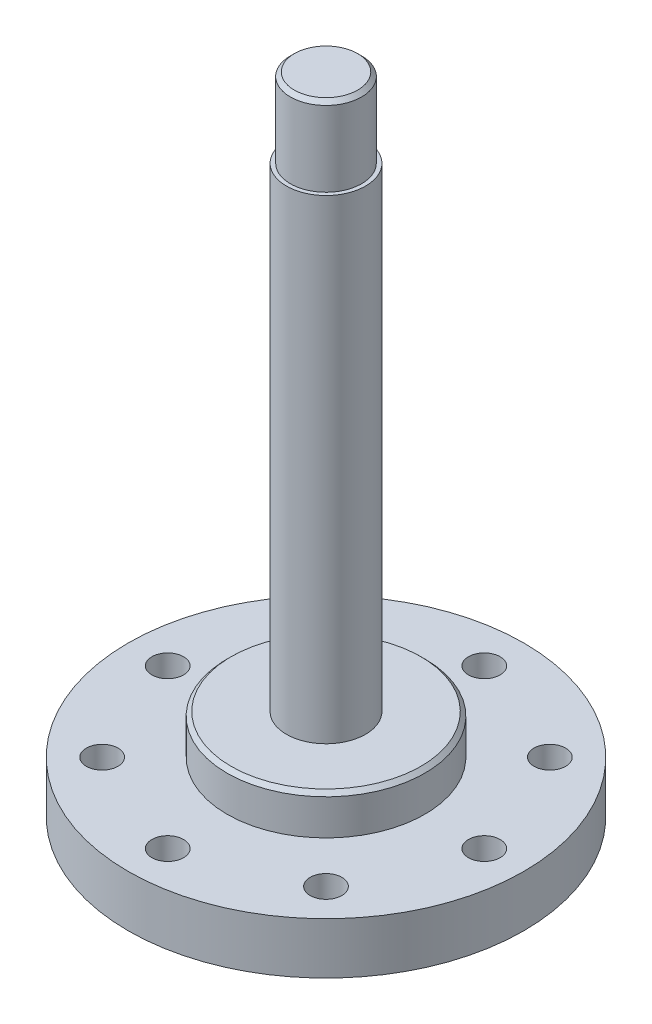
ISO-10303-21;
HEADER;
FILE_DESCRIPTION(('STEP AP214'),'2;1');
FILE_NAME('part.step','',(''),(''),'','','');
FILE_SCHEMA(('AUTOMOTIVE_DESIGN { 1 0 10303 214 1 1 1 1 }'));
ENDSEC;
DATA;
#1=APPLICATION_CONTEXT('core data for automotive mechanical design processes');
#2=APPLICATION_PROTOCOL_DEFINITION('international standard','automotive_design',2000,#1);
#3=PRODUCT_CONTEXT('',#1,'mechanical');
#4=PRODUCT('Part','Part','',(#3));
#5=PRODUCT_RELATED_PRODUCT_CATEGORY('part','',(#4));
#6=PRODUCT_DEFINITION_FORMATION('','',#4);
#7=PRODUCT_DEFINITION_CONTEXT('part definition',#1,'design');
#8=PRODUCT_DEFINITION('design','',#6,#7);
#9=PRODUCT_DEFINITION_SHAPE('','',#8);
#10=(LENGTH_UNIT() NAMED_UNIT(*) SI_UNIT(.MILLI.,.METRE.));
#11=(NAMED_UNIT(*) PLANE_ANGLE_UNIT() SI_UNIT($,.RADIAN.));
#12=(NAMED_UNIT(*) SI_UNIT($,.STERADIAN.) SOLID_ANGLE_UNIT());
#13=UNCERTAINTY_MEASURE_WITH_UNIT(LENGTH_MEASURE(1.E-05),#10,'distance_accuracy_value','');
#14=(GEOMETRIC_REPRESENTATION_CONTEXT(3) GLOBAL_UNCERTAINTY_ASSIGNED_CONTEXT((#13)) GLOBAL_UNIT_ASSIGNED_CONTEXT((#10,
#11,#12)) REPRESENTATION_CONTEXT('',''));
#15=CARTESIAN_POINT('',(0.,0.,0.));
#16=DIRECTION('',(0.,0.,1.));
#17=DIRECTION('',(1.,0.,0.));
#18=AXIS2_PLACEMENT_3D('',#15,#16,#17);
#19=CARTESIAN_POINT('',(0.,0.,0.));
#20=DIRECTION('',(0.,-1.,0.));
#21=DIRECTION('',(0.,0.,-1.));
#22=AXIS2_PLACEMENT_3D('',#19,#20,#21);
#23=CYLINDRICAL_SURFACE('',#22,8.99999999999997);
#24=CARTESIAN_POINT('',(-2.,158.000000000003,-8.77496438739209));
#25=CARTESIAN_POINT('',(-2.00000045322512,158.055525070062,-8.7749611563832));
#26=CARTESIAN_POINT('',(-1.99768625513154,158.111022831997,-8.77549207437707));
#27=CARTESIAN_POINT('',(-1.98845940647227,158.221607238545,-8.7775886458812));
#28=CARTESIAN_POINT('',(-1.98154740935906,158.276693940454,-8.77915415235256));
#29=CARTESIAN_POINT('',(-1.95400769283988,158.440542767895,-8.78534174037962));
#30=CARTESIAN_POINT('',(-1.92657587259378,158.548185220393,-8.79145523457123));
#31=CARTESIAN_POINT('',(-1.85442825068594,158.757191285253,-8.80695400655512));
#32=CARTESIAN_POINT('',(-1.80971170740661,158.858554627988,-8.81633942473073));
#33=CARTESIAN_POINT('',(-1.70430928768159,159.052376151746,-8.83731901887102));
#34=CARTESIAN_POINT('',(-1.64362124795972,159.144833124117,-8.84891349398498));
#35=CARTESIAN_POINT('',(-1.50689095324053,159.319771479346,-8.87322727978757));
#36=CARTESIAN_POINT('',(-1.43062605084004,159.402076754204,-8.88596119650304));
#37=CARTESIAN_POINT('',(-1.26535813485257,159.552863054087,-8.91099554522235));
#38=CARTESIAN_POINT('',(-1.1763505255725,159.621339069978,-8.9232958188283));
#39=CARTESIAN_POINT('',(-0.986915380029121,159.743223646819,-8.946239194565));
#40=CARTESIAN_POINT('',(-0.886370405253414,159.796453627775,-8.95686204964387));
#41=CARTESIAN_POINT('',(-0.677557914875121,159.885139541732,-8.97506836310517));
#42=CARTESIAN_POINT('',(-0.569299770399321,159.920616636733,-8.98265543805999));
#43=CARTESIAN_POINT('',(-0.383738033770627,159.964358638689,-8.9921311167354));
#44=CARTESIAN_POINT('',(-0.307646152012311,159.977702266425,-8.99506700135329));
#45=CARTESIAN_POINT('',(-0.154380127231377,159.995524598139,-8.99900234711577));
#46=CARTESIAN_POINT('',(-0.0772059904160005,160.000003352939,-9.00000181936202));
#47=CARTESIAN_POINT('',(0.110852613716563,159.999995185839,-8.99999738775399));
#48=CARTESIAN_POINT('',(0.221770894619487,159.990750367457,-8.99793058177931));
#49=CARTESIAN_POINT('',(0.440474710707489,159.954047573632,-8.98988281570509));
#50=CARTESIAN_POINT('',(0.548257064254706,159.926571730904,-8.98389801585935));
#51=CARTESIAN_POINT('',(0.757464524262974,159.854313239147,-8.96868093927848));
#52=CARTESIAN_POINT('',(0.858896984777141,159.809551057744,-8.95945250427693));
#53=CARTESIAN_POINT('',(1.05280412699015,159.704050920115,-8.93874290359373));
#54=CARTESIAN_POINT('',(1.14527934033796,159.643313912855,-8.92726187173537));
#55=CARTESIAN_POINT('',(1.32018428707594,159.506526044706,-8.90309121222285));
#56=CARTESIAN_POINT('',(1.40244487062325,159.430261609018,-8.89038619714368));
#57=CARTESIAN_POINT('',(1.55312203235356,159.265035087475,-8.86530653184287));
#58=CARTESIAN_POINT('',(1.62153673721995,159.176071286196,-8.85293192652127));
#59=CARTESIAN_POINT('',(1.74334148086182,158.986703861682,-8.82976004663997));
#60=CARTESIAN_POINT('',(1.79654618585851,158.88617846954,-8.81898294101116));
#61=CARTESIAN_POINT('',(1.88521500543983,158.677354247113,-8.80045616785831));
#62=CARTESIAN_POINT('',(1.92069140804127,158.569060860758,-8.79270440419771));
#63=CARTESIAN_POINT('',(1.96440898267864,158.383471081341,-8.78301933671262));
#64=CARTESIAN_POINT('',(1.97773794761973,158.307390305809,-8.78001690428314));
#65=CARTESIAN_POINT('',(1.99553735430618,158.154219220793,-8.77598160009122));
#66=CARTESIAN_POINT('',(2.00001581907926,158.077129889455,-8.77494694456012));
#67=CARTESIAN_POINT('',(2.,158.,-8.7749643873921));
#68=B_SPLINE_CURVE_WITH_KNOTS('',3,(#24,#25,#26,#27,#28,#29,#30,#31,#32,#33,#34,#35,#36,#37,#38,
#39,#40,#41,#42,#43,#44,#45,#46,#47,#48,#49,#50,#51,#52,#53,#54,#55,#56,#57,#58,#59,#60,#61,#62,
#63,#64,#65,#66,#67),.UNSPECIFIED.,.F.,.F.,(4,2,2,2,2,2,2,2,2,2,2,2,2,2,2,2,2,2,2,2,2,4),(0.,
0.16647063367442,0.33291761311478,0.664948115280802,0.996992865114983,1.32908261226772,
1.66630095736818,2.00364122903178,2.34478479664195,2.68552073582845,2.91694151254844,
3.14836096250377,3.48063376613172,3.81323269508712,4.14543901682384,4.47762560866963,
4.81473430369558,5.15188857833218,5.49299120598956,5.83385707613412,6.06524315893335,
6.2964193925688),.UNSPECIFIED.);
#69=CARTESIAN_POINT('',(-2.,158.000000000003,-8.77496438739209));
#70=VERTEX_POINT('',#69);
#71=CARTESIAN_POINT('',(2.,158.,-8.77496438739209));
#72=VERTEX_POINT('',#71);
#73=EDGE_CURVE('E139',#70,#72,#68,.T.);
#74=ORIENTED_EDGE('',*,*,#73,.F.);
#75=DIRECTION('',(0.,-1.,0.));
#76=VECTOR('',#75,1.);
#77=CARTESIAN_POINT('',(-2.00000000000006,0.,-8.77496438739208));
#78=LINE('',#77,#76);
#79=CARTESIAN_POINT('',(-2.,148.000000000003,-8.77496438739209));
#80=VERTEX_POINT('',#79);
#81=EDGE_CURVE('E134',#80,#70,#78,.F.);
#82=ORIENTED_EDGE('',*,*,#81,.F.);
#83=CARTESIAN_POINT('',(2.,148.,-8.77496438739209));
#84=CARTESIAN_POINT('',(2.00000045322516,147.944474929942,-8.77496115638318));
#85=CARTESIAN_POINT('',(1.9976862551317,147.888977168006,-8.77549207437703));
#86=CARTESIAN_POINT('',(1.98845940647267,147.778392761458,-8.77758864588111));
#87=CARTESIAN_POINT('',(1.98154740935959,147.723306059549,-8.77915415235244));
#88=CARTESIAN_POINT('',(1.95400769284051,147.559457232108,-8.78534174037948));
#89=CARTESIAN_POINT('',(1.92657587259412,147.45181477961,-8.79145523457115));
#90=CARTESIAN_POINT('',(1.85442825068672,147.24280871475,-8.80695400655496));
#91=CARTESIAN_POINT('',(1.80971170740813,147.141445372015,-8.81633942473043));
#92=CARTESIAN_POINT('',(1.7043092876832,146.947623848257,-8.8373190188707));
#93=CARTESIAN_POINT('',(1.64362124796069,146.855166875886,-8.84891349398479));
#94=CARTESIAN_POINT('',(1.50689095324172,146.680228520657,-8.87322727978738));
#95=CARTESIAN_POINT('',(1.43062605084209,146.597923245798,-8.88596119650272));
#96=CARTESIAN_POINT('',(1.26535813485479,146.447136945915,-8.91099554522202));
#97=CARTESIAN_POINT('',(1.17635052557401,146.378660930025,-8.92329581882809));
#98=CARTESIAN_POINT('',(0.986915380030634,146.256776353184,-8.94623919456484));
#99=CARTESIAN_POINT('',(0.886370405255663,146.203546372226,-8.95686204964365));
#100=CARTESIAN_POINT('',(0.677557914877532,146.114860458269,-8.97506836310497));
#101=CARTESIAN_POINT('',(0.569299770401157,146.079383363269,-8.98265543805986));
#102=CARTESIAN_POINT('',(0.38373803377203,146.035641361312,-8.99213111673534));
#103=CARTESIAN_POINT('',(0.30764615201358,146.022297733575,-8.99506700135325));
#104=CARTESIAN_POINT('',(0.154380127232152,146.004475401861,-8.99900234711576));
#105=CARTESIAN_POINT('',(0.0772059904164161,145.999996647061,-9.00000181936202));
#106=CARTESIAN_POINT('',(-0.110852613716602,146.000004814161,-8.99999738775399));
#107=CARTESIAN_POINT('',(-0.221770894619627,146.009249632542,-8.99793058177931));
#108=CARTESIAN_POINT('',(-0.440474710707477,146.045952426368,-8.98988281570509));
#109=CARTESIAN_POINT('',(-0.548257064254439,146.073428269097,-8.98389801585938));
#110=CARTESIAN_POINT('',(-0.757464524263099,146.145686760854,-8.96868093927846));
#111=CARTESIAN_POINT('',(-0.858896984777914,146.190448942256,-8.95945250427684));
#112=CARTESIAN_POINT('',(-1.05280412699083,146.295949079886,-8.93874290359366));
#113=CARTESIAN_POINT('',(-1.1452793403379,146.356686087146,-8.92726187173539));
#114=CARTESIAN_POINT('',(-1.32018428707592,146.493473955296,-8.90309121222284));
#115=CARTESIAN_POINT('',(-1.40244487062404,146.569738390983,-8.89038619714355));
#116=CARTESIAN_POINT('',(-1.55312203235438,146.734964912526,-8.86530653184274));
#117=CARTESIAN_POINT('',(-1.62153673721999,146.823928713805,-8.85293192652127));
#118=CARTESIAN_POINT('',(-1.74334148086173,147.01329613832,-8.82976004663998));
#119=CARTESIAN_POINT('',(-1.79654618585907,147.113821530461,-8.81898294101104));
#120=CARTESIAN_POINT('',(-1.88521500544048,147.322645752889,-8.80045616785818));
#121=CARTESIAN_POINT('',(-1.92069140804134,147.430939139243,-8.79270440419769));
#122=CARTESIAN_POINT('',(-1.96440898267863,147.616528918661,-8.78301933671262));
#123=CARTESIAN_POINT('',(-1.97773794761993,147.692609694193,-8.7800169042831));
#124=CARTESIAN_POINT('',(-1.99553735430657,147.84578077921,-8.77598160009113));
#125=CARTESIAN_POINT('',(-2.00001581907965,147.922870110549,-8.77494694456003));
#126=CARTESIAN_POINT('',(-2.,148.000000000003,-8.7749643873921));
#127=B_SPLINE_CURVE_WITH_KNOTS('',3,(#83,#84,#85,#86,#87,#88,#89,#90,#91,#92,#93,#94,#95,#96,
#97,#98,#99,#100,#101,#102,#103,#104,#105,#106,#107,#108,#109,#110,#111,#112,#113,#114,#115,
#116,#117,#118,#119,#120,#121,#122,#123,#124,#125,#126),.UNSPECIFIED.,.F.,.F.,(4,2,2,2,2,2,2,2,
2,2,2,2,2,2,2,2,2,2,2,2,2,4),(0.,0.166470633674519,0.332917613114842,0.664948115280836,
0.996992865115027,1.32908261226785,1.66630095736847,2.00364122903209,2.3447847966423,
2.68552073582904,2.91694151255013,3.14836096250641,3.48063376613443,3.81323269509017,
4.14543901682713,4.47762560867294,4.81473430369895,5.15188857833571,5.49299120599317,
5.83385707613773,6.06524315893786,6.29641939257422),.UNSPECIFIED.);
#128=CARTESIAN_POINT('',(2.,148.,-8.77496438739211));
#129=VERTEX_POINT('',#128);
#130=EDGE_CURVE('E148',#129,#80,#127,.T.);
#131=ORIENTED_EDGE('',*,*,#130,.F.);
#132=DIRECTION('',(0.,-1.,0.));
#133=VECTOR('',#132,1.);
#134=CARTESIAN_POINT('',(2.,0.,-8.77496438739209));
#135=LINE('',#134,#133);
#136=EDGE_CURVE('E146',#129,#72,#135,.F.);
#137=ORIENTED_EDGE('',*,*,#136,.T.);
#138=EDGE_LOOP('',(#74,#82,#131,#137));
#139=FACE_BOUND('',#138,.T.);
#140=CARTESIAN_POINT('',(0.,162.,0.));
#141=DIRECTION('',(0.,1.,0.));
#142=DIRECTION('',(0.,0.,1.));
#143=AXIS2_PLACEMENT_3D('',#140,#141,#142);
#144=CIRCLE('',#143,8.99999999999997);
#145=CARTESIAN_POINT('',(0.,162.,8.99999999999997));
#146=VERTEX_POINT('',#145);
#147=EDGE_CURVE('E218',#146,#146,#144,.F.);
#148=ORIENTED_EDGE('',*,*,#147,.T.);
#149=EDGE_LOOP('',(#148));
#150=FACE_BOUND('',#149,.T.);
#151=CARTESIAN_POINT('',(0.,143.,0.));
#152=DIRECTION('',(0.,-1.,0.));
#153=DIRECTION('',(0.,0.,-1.));
#154=AXIS2_PLACEMENT_3D('',#151,#152,#153);
#155=CIRCLE('',#154,9.);
#156=CARTESIAN_POINT('',(0.,143.,-9.));
#157=VERTEX_POINT('',#156);
#158=EDGE_CURVE('E253',#157,#157,#155,.T.);
#159=ORIENTED_EDGE('',*,*,#158,.F.);
#160=EDGE_LOOP('',(#159));
#161=FACE_BOUND('',#160,.T.);
#162=ADVANCED_FACE('F74',(#139,#150,#161),#23,.T.);
#163=CARTESIAN_POINT('',(0.,0.,0.));
#164=DIRECTION('',(0.,-1.,0.));
#165=DIRECTION('',(0.,0.,-1.));
#166=AXIS2_PLACEMENT_3D('',#163,#164,#165);
#167=PLANE('',#166);
#168=CARTESIAN_POINT('',(-28.2842712474621,0.,-28.2842712474618));
#169=DIRECTION('',(0.,-1.,0.));
#170=DIRECTION('',(0.,0.,-1.));
#171=AXIS2_PLACEMENT_3D('',#168,#169,#170);
#172=CIRCLE('',#171,4.);
#173=CARTESIAN_POINT('',(-28.2842712474621,0.,-32.2842712474617));
#174=VERTEX_POINT('',#173);
#175=EDGE_CURVE('E283',#174,#174,#172,.T.);
#176=ORIENTED_EDGE('',*,*,#175,.F.);
#177=EDGE_LOOP('',(#176));
#178=FACE_BOUND('',#177,.T.);
#179=CARTESIAN_POINT('',(-1.39659253553725E-13,0.,-40.));
#180=DIRECTION('',(0.,-1.,0.));
#181=DIRECTION('',(0.,0.,-1.));
#182=AXIS2_PLACEMENT_3D('',#179,#180,#181);
#183=CIRCLE('',#182,4.);
#184=CARTESIAN_POINT('',(-1.39659253553725E-13,0.,-44.));
#185=VERTEX_POINT('',#184);
#186=EDGE_CURVE('E291',#185,#185,#183,.T.);
#187=ORIENTED_EDGE('',*,*,#186,.F.);
#188=EDGE_LOOP('',(#187));
#189=FACE_BOUND('',#188,.T.);
#190=CARTESIAN_POINT('',(28.2842712474619,0.,-28.284271247462));
#191=DIRECTION('',(0.,-1.,0.));
#192=DIRECTION('',(0.,0.,-1.));
#193=AXIS2_PLACEMENT_3D('',#190,#191,#192);
#194=CIRCLE('',#193,4.);
#195=CARTESIAN_POINT('',(28.2842712474619,0.,-32.284271247462));
#196=VERTEX_POINT('',#195);
#197=EDGE_CURVE('E287',#196,#196,#194,.T.);
#198=ORIENTED_EDGE('',*,*,#197,.F.);
#199=EDGE_LOOP('',(#198));
#200=FACE_BOUND('',#199,.T.);
#201=CARTESIAN_POINT('',(40.,0.,0.));
#202=DIRECTION('',(0.,-1.,0.));
#203=DIRECTION('',(0.,0.,-1.));
#204=AXIS2_PLACEMENT_3D('',#201,#202,#203);
#205=CIRCLE('',#204,4.);
#206=CARTESIAN_POINT('',(40.,0.,-4.));
#207=VERTEX_POINT('',#206);
#208=EDGE_CURVE('E284',#207,#207,#205,.T.);
#209=ORIENTED_EDGE('',*,*,#208,.F.);
#210=EDGE_LOOP('',(#209));
#211=FACE_BOUND('',#210,.T.);
#212=CARTESIAN_POINT('',(28.2842712474622,0.,28.2842712474616));
#213=DIRECTION('',(0.,-1.,0.));
#214=DIRECTION('',(0.,0.,-1.));
#215=AXIS2_PLACEMENT_3D('',#212,#213,#214);
#216=CIRCLE('',#215,4.);
#217=CARTESIAN_POINT('',(28.2842712474622,0.,24.2842712474616));
#218=VERTEX_POINT('',#217);
#219=EDGE_CURVE('E288',#218,#218,#216,.T.);
#220=ORIENTED_EDGE('',*,*,#219,.F.);
#221=EDGE_LOOP('',(#220));
#222=FACE_BOUND('',#221,.T.);
#223=CARTESIAN_POINT('',(4.18977760661176E-13,0.,40.));
#224=DIRECTION('',(0.,-1.,0.));
#225=DIRECTION('',(0.,0.,-1.));
#226=AXIS2_PLACEMENT_3D('',#223,#224,#225);
#227=CIRCLE('',#226,4.);
#228=CARTESIAN_POINT('',(4.18977760661176E-13,0.,36.));
#229=VERTEX_POINT('',#228);
#230=EDGE_CURVE('E299',#229,#229,#227,.T.);
#231=ORIENTED_EDGE('',*,*,#230,.F.);
#232=EDGE_LOOP('',(#231));
#233=FACE_BOUND('',#232,.T.);
#234=CARTESIAN_POINT('',(-40.,0.,2.79318507107451E-13));
#235=DIRECTION('',(0.,-1.,0.));
#236=DIRECTION('',(0.,0.,-1.));
#237=AXIS2_PLACEMENT_3D('',#234,#235,#236);
#238=CIRCLE('',#237,4.);
#239=CARTESIAN_POINT('',(-40.,0.,-3.99999999999972));
#240=VERTEX_POINT('',#239);
#241=EDGE_CURVE('E296',#240,#240,#238,.T.);
#242=ORIENTED_EDGE('',*,*,#241,.F.);
#243=EDGE_LOOP('',(#242));
#244=FACE_BOUND('',#243,.T.);
#245=CARTESIAN_POINT('',(-28.2842712474617,0.,28.2842712474621));
#246=DIRECTION('',(0.,-1.,0.));
#247=DIRECTION('',(0.,0.,-1.));
#248=AXIS2_PLACEMENT_3D('',#245,#246,#247);
#249=CIRCLE('',#248,3.99999999999999);
#250=CARTESIAN_POINT('',(-28.2842712474617,0.,24.2842712474622));
#251=VERTEX_POINT('',#250);
#252=EDGE_CURVE('E234',#251,#251,#249,.T.);
#253=ORIENTED_EDGE('',*,*,#252,.F.);
#254=EDGE_LOOP('',(#253));
#255=FACE_BOUND('',#254,.T.);
#256=CARTESIAN_POINT('',(0.,0.,0.));
#257=DIRECTION('',(0.,-1.,0.));
#258=DIRECTION('',(0.,0.,-1.));
#259=AXIS2_PLACEMENT_3D('',#256,#257,#258);
#260=CIRCLE('',#259,50.);
#261=CARTESIAN_POINT('',(0.,0.,-50.));
#262=VERTEX_POINT('',#261);
#263=EDGE_CURVE('E220',#262,#262,#260,.T.);
#264=ORIENTED_EDGE('',*,*,#263,.T.);
#265=EDGE_LOOP('',(#264));
#266=FACE_BOUND('',#265,.T.);
#267=ADVANCED_FACE('F168',(#178,#189,#200,#211,#222,#233,#244,#255,#266),#167,.T.);
#268=CARTESIAN_POINT('',(0.,0.,0.));
#269=DIRECTION('',(0.,-1.,0.));
#270=DIRECTION('',(0.,0.,-1.));
#271=AXIS2_PLACEMENT_3D('',#268,#269,#270);
#272=CYLINDRICAL_SURFACE('',#271,50.);
#273=CARTESIAN_POINT('',(0.,13.,0.));
#274=DIRECTION('',(0.,-1.,0.));
#275=DIRECTION('',(0.,0.,-1.));
#276=AXIS2_PLACEMENT_3D('',#273,#274,#275);
#277=CIRCLE('',#276,50.);
#278=CARTESIAN_POINT('',(0.,13.,-50.));
#279=VERTEX_POINT('',#278);
#280=EDGE_CURVE('E224',#279,#279,#277,.T.);
#281=ORIENTED_EDGE('',*,*,#280,.T.);
#282=EDGE_LOOP('',(#281));
#283=FACE_BOUND('',#282,.T.);
#284=ORIENTED_EDGE('',*,*,#263,.F.);
#285=EDGE_LOOP('',(#284));
#286=FACE_BOUND('',#285,.T.);
#287=ADVANCED_FACE('F192',(#283,#286),#272,.T.);
#288=CARTESIAN_POINT('',(0.,13.,-50.));
#289=DIRECTION('',(0.,1.,0.));
#290=DIRECTION('',(0.,0.,1.));
#291=AXIS2_PLACEMENT_3D('',#288,#289,#290);
#292=PLANE('',#291);
#293=CARTESIAN_POINT('',(-28.2842712474621,13.,-28.2842712474618));
#294=DIRECTION('',(0.,1.,0.));
#295=DIRECTION('',(0.,0.,1.));
#296=AXIS2_PLACEMENT_3D('',#293,#294,#295);
#297=CIRCLE('',#296,4.);
#298=CARTESIAN_POINT('',(-28.2842712474621,13.,-24.2842712474618));
#299=VERTEX_POINT('',#298);
#300=EDGE_CURVE('E79',#299,#299,#297,.T.);
#301=ORIENTED_EDGE('',*,*,#300,.F.);
#302=EDGE_LOOP('',(#301));
#303=FACE_BOUND('',#302,.T.);
#304=CARTESIAN_POINT('',(-1.39659253553725E-13,13.,-40.));
#305=DIRECTION('',(0.,1.,0.));
#306=DIRECTION('',(0.,0.,1.));
#307=AXIS2_PLACEMENT_3D('',#304,#305,#306);
#308=CIRCLE('',#307,4.);
#309=CARTESIAN_POINT('',(-1.39659253553725E-13,13.,-36.));
#310=VERTEX_POINT('',#309);
#311=EDGE_CURVE('E248',#310,#310,#308,.T.);
#312=ORIENTED_EDGE('',*,*,#311,.F.);
#313=EDGE_LOOP('',(#312));
#314=FACE_BOUND('',#313,.T.);
#315=CARTESIAN_POINT('',(28.2842712474619,13.,-28.284271247462));
#316=DIRECTION('',(0.,1.,0.));
#317=DIRECTION('',(0.,0.,1.));
#318=AXIS2_PLACEMENT_3D('',#315,#316,#317);
#319=CIRCLE('',#318,4.);
#320=CARTESIAN_POINT('',(28.2842712474619,13.,-24.284271247462));
#321=VERTEX_POINT('',#320);
#322=EDGE_CURVE('E246',#321,#321,#319,.T.);
#323=ORIENTED_EDGE('',*,*,#322,.F.);
#324=EDGE_LOOP('',(#323));
#325=FACE_BOUND('',#324,.T.);
#326=CARTESIAN_POINT('',(40.,13.,0.));
#327=DIRECTION('',(0.,1.,0.));
#328=DIRECTION('',(0.,0.,1.));
#329=AXIS2_PLACEMENT_3D('',#326,#327,#328);
#330=CIRCLE('',#329,4.);
#331=CARTESIAN_POINT('',(40.,13.,4.));
#332=VERTEX_POINT('',#331);
#333=EDGE_CURVE('E243',#332,#332,#330,.T.);
#334=ORIENTED_EDGE('',*,*,#333,.F.);
#335=EDGE_LOOP('',(#334));
#336=FACE_BOUND('',#335,.T.);
#337=CARTESIAN_POINT('',(28.2842712474622,13.,28.2842712474616));
#338=DIRECTION('',(0.,1.,0.));
#339=DIRECTION('',(0.,0.,1.));
#340=AXIS2_PLACEMENT_3D('',#337,#338,#339);
#341=CIRCLE('',#340,4.);
#342=CARTESIAN_POINT('',(28.2842712474622,13.,32.2842712474616));
#343=VERTEX_POINT('',#342);
#344=EDGE_CURVE('E240',#343,#343,#341,.T.);
#345=ORIENTED_EDGE('',*,*,#344,.F.);
#346=EDGE_LOOP('',(#345));
#347=FACE_BOUND('',#346,.T.);
#348=CARTESIAN_POINT('',(4.18977760661176E-13,13.,40.));
#349=DIRECTION('',(0.,1.,0.));
#350=DIRECTION('',(0.,0.,1.));
#351=AXIS2_PLACEMENT_3D('',#348,#349,#350);
#352=CIRCLE('',#351,4.);
#353=CARTESIAN_POINT('',(4.18977760661176E-13,13.,44.));
#354=VERTEX_POINT('',#353);
#355=EDGE_CURVE('E237',#354,#354,#352,.T.);
#356=ORIENTED_EDGE('',*,*,#355,.F.);
#357=EDGE_LOOP('',(#356));
#358=FACE_BOUND('',#357,.T.);
#359=CARTESIAN_POINT('',(-40.,13.,2.79318507107451E-13));
#360=DIRECTION('',(0.,1.,0.));
#361=DIRECTION('',(0.,0.,1.));
#362=AXIS2_PLACEMENT_3D('',#359,#360,#361);
#363=CIRCLE('',#362,4.);
#364=CARTESIAN_POINT('',(-40.,13.,4.00000000000028));
#365=VERTEX_POINT('',#364);
#366=EDGE_CURVE('E233',#365,#365,#363,.T.);
#367=ORIENTED_EDGE('',*,*,#366,.F.);
#368=EDGE_LOOP('',(#367));
#369=FACE_BOUND('',#368,.T.);
#370=CARTESIAN_POINT('',(-28.2842712474617,13.,28.2842712474621));
#371=DIRECTION('',(0.,1.,0.));
#372=DIRECTION('',(0.,0.,1.));
#373=AXIS2_PLACEMENT_3D('',#370,#371,#372);
#374=CIRCLE('',#373,3.99999999999999);
#375=CARTESIAN_POINT('',(-28.2842712474617,13.,32.2842712474621));
#376=VERTEX_POINT('',#375);
#377=EDGE_CURVE('E230',#376,#376,#374,.T.);
#378=ORIENTED_EDGE('',*,*,#377,.F.);
#379=EDGE_LOOP('',(#378));
#380=FACE_BOUND('',#379,.T.);
#381=CARTESIAN_POINT('',(0.,13.,0.));
#382=DIRECTION('',(0.,-1.,0.));
#383=DIRECTION('',(0.,0.,-1.));
#384=AXIS2_PLACEMENT_3D('',#381,#382,#383);
#385=CIRCLE('',#384,25.);
#386=CARTESIAN_POINT('',(0.,13.,-25.));
#387=VERTEX_POINT('',#386);
#388=EDGE_CURVE('E268',#387,#387,#385,.T.);
#389=ORIENTED_EDGE('',*,*,#388,.T.);
#390=EDGE_LOOP('',(#389));
#391=FACE_BOUND('',#390,.T.);
#392=ORIENTED_EDGE('',*,*,#280,.F.);
#393=EDGE_LOOP('',(#392));
#394=FACE_BOUND('',#393,.T.);
#395=ADVANCED_FACE('F188',(#303,#314,#325,#336,#347,#358,#369,#380,#391,#394),#292,.T.);
#396=CARTESIAN_POINT('',(0.,0.,0.));
#397=DIRECTION('',(0.,-1.,0.));
#398=DIRECTION('',(0.,0.,-1.));
#399=AXIS2_PLACEMENT_3D('',#396,#397,#398);
#400=CYLINDRICAL_SURFACE('',#399,25.);
#401=CARTESIAN_POINT('',(0.,22.,0.));
#402=DIRECTION('',(0.,1.,0.));
#403=DIRECTION('',(0.,0.,1.));
#404=AXIS2_PLACEMENT_3D('',#401,#402,#403);
#405=CIRCLE('',#404,25.);
#406=CARTESIAN_POINT('',(0.,22.,25.));
#407=VERTEX_POINT('',#406);
#408=EDGE_CURVE('E84',#407,#407,#405,.F.);
#409=ORIENTED_EDGE('',*,*,#408,.T.);
#410=EDGE_LOOP('',(#409));
#411=FACE_BOUND('',#410,.T.);
#412=ORIENTED_EDGE('',*,*,#388,.F.);
#413=EDGE_LOOP('',(#412));
#414=FACE_BOUND('',#413,.T.);
#415=ADVANCED_FACE('F184',(#411,#414),#400,.T.);
#416=CARTESIAN_POINT('',(0.,23.,-25.));
#417=DIRECTION('',(0.,1.,0.));
#418=DIRECTION('',(0.,0.,1.));
#419=AXIS2_PLACEMENT_3D('',#416,#417,#418);
#420=PLANE('',#419);
#421=CARTESIAN_POINT('',(0.,23.,0.));
#422=DIRECTION('',(0.,1.,0.));
#423=DIRECTION('',(0.,0.,1.));
#424=AXIS2_PLACEMENT_3D('',#421,#422,#423);
#425=CIRCLE('',#424,24.);
#426=CARTESIAN_POINT('',(0.,23.,24.));
#427=VERTEX_POINT('',#426);
#428=EDGE_CURVE('E12',#427,#427,#425,.T.);
#429=ORIENTED_EDGE('',*,*,#428,.T.);
#430=EDGE_LOOP('',(#429));
#431=FACE_BOUND('',#430,.T.);
#432=CARTESIAN_POINT('',(0.,23.,0.));
#433=DIRECTION('',(0.,-1.,0.));
#434=DIRECTION('',(0.,0.,-1.));
#435=AXIS2_PLACEMENT_3D('',#432,#433,#434);
#436=CIRCLE('',#435,10.);
#437=CARTESIAN_POINT('',(0.,23.,-10.));
#438=VERTEX_POINT('',#437);
#439=EDGE_CURVE('E261',#438,#438,#436,.T.);
#440=ORIENTED_EDGE('',*,*,#439,.T.);
#441=EDGE_LOOP('',(#440));
#442=FACE_BOUND('',#441,.T.);
#443=ADVANCED_FACE('F180',(#431,#442),#420,.T.);
#444=CARTESIAN_POINT('',(0.,0.,0.));
#445=DIRECTION('',(0.,-1.,0.));
#446=DIRECTION('',(0.,0.,-1.));
#447=AXIS2_PLACEMENT_3D('',#444,#445,#446);
#448=CYLINDRICAL_SURFACE('',#447,10.);
#449=CARTESIAN_POINT('',(0.,143.,0.));
#450=DIRECTION('',(0.,-1.,0.));
#451=DIRECTION('',(0.,0.,-1.));
#452=AXIS2_PLACEMENT_3D('',#449,#450,#451);
#453=CIRCLE('',#452,10.);
#454=CARTESIAN_POINT('',(0.,143.,-10.));
#455=VERTEX_POINT('',#454);
#456=EDGE_CURVE('E257',#455,#455,#453,.T.);
#457=ORIENTED_EDGE('',*,*,#456,.T.);
#458=EDGE_LOOP('',(#457));
#459=FACE_BOUND('',#458,.T.);
#460=ORIENTED_EDGE('',*,*,#439,.F.);
#461=EDGE_LOOP('',(#460));
#462=FACE_BOUND('',#461,.T.);
#463=ADVANCED_FACE('F176',(#459,#462),#448,.T.);
#464=CARTESIAN_POINT('',(0.,143.,-10.));
#465=DIRECTION('',(0.,1.,0.));
#466=DIRECTION('',(0.,0.,1.));
#467=AXIS2_PLACEMENT_3D('',#464,#465,#466);
#468=PLANE('',#467);
#469=ORIENTED_EDGE('',*,*,#158,.T.);
#470=EDGE_LOOP('',(#469));
#471=FACE_BOUND('',#470,.T.);
#472=ORIENTED_EDGE('',*,*,#456,.F.);
#473=EDGE_LOOP('',(#472));
#474=FACE_BOUND('',#473,.T.);
#475=ADVANCED_FACE('F172',(#471,#474),#468,.T.);
#476=CARTESIAN_POINT('',(0.,163.,-8.99999999999994));
#477=DIRECTION('',(0.,1.,0.));
#478=DIRECTION('',(0.,0.,1.));
#479=AXIS2_PLACEMENT_3D('',#476,#477,#478);
#480=PLANE('',#479);
#481=CARTESIAN_POINT('',(0.,163.,0.));
#482=DIRECTION('',(0.,1.,0.));
#483=DIRECTION('',(0.,0.,1.));
#484=AXIS2_PLACEMENT_3D('',#481,#482,#483);
#485=CIRCLE('',#484,7.99999999999995);
#486=CARTESIAN_POINT('',(0.,163.,7.99999999999995));
#487=VERTEX_POINT('',#486);
#488=EDGE_CURVE('E215',#487,#487,#485,.T.);
#489=ORIENTED_EDGE('',*,*,#488,.T.);
#490=EDGE_LOOP('',(#489));
#491=FACE_BOUND('',#490,.T.);
#492=ADVANCED_FACE('F170',(#491),#480,.T.);
#493=CARTESIAN_POINT('',(0.,162.,0.));
#494=DIRECTION('',(0.,-1.,0.));
#495=DIRECTION('',(0.,0.,-1.));
#496=AXIS2_PLACEMENT_3D('',#493,#494,#495);
#497=CONICAL_SURFACE('',#496,8.99999999999997,0.785398163397445);
#498=ORIENTED_EDGE('',*,*,#488,.F.);
#499=EDGE_LOOP('',(#498));
#500=FACE_BOUND('',#499,.T.);
#501=ORIENTED_EDGE('',*,*,#147,.F.);
#502=EDGE_LOOP('',(#501));
#503=FACE_BOUND('',#502,.T.);
#504=ADVANCED_FACE('F200',(#500,#503),#497,.T.);
#505=CARTESIAN_POINT('',(0.,22.,0.));
#506=DIRECTION('',(0.,-1.,0.));
#507=DIRECTION('',(0.,0.,-1.));
#508=AXIS2_PLACEMENT_3D('',#505,#506,#507);
#509=CONICAL_SURFACE('',#508,25.,0.78539816339745);
#510=ORIENTED_EDGE('',*,*,#428,.F.);
#511=EDGE_LOOP('',(#510));
#512=FACE_BOUND('',#511,.T.);
#513=ORIENTED_EDGE('',*,*,#408,.F.);
#514=EDGE_LOOP('',(#513));
#515=FACE_BOUND('',#514,.T.);
#516=ADVANCED_FACE('F77',(#512,#515),#509,.T.);
#517=CARTESIAN_POINT('',(-28.2842712474617,163.,28.2842712474621));
#518=DIRECTION('',(0.,-1.,0.));
#519=DIRECTION('',(0.,0.,-1.));
#520=AXIS2_PLACEMENT_3D('',#517,#518,#519);
#521=CYLINDRICAL_SURFACE('',#520,3.99999999999999);
#522=ORIENTED_EDGE('',*,*,#377,.T.);
#523=EDGE_LOOP('',(#522));
#524=FACE_BOUND('',#523,.T.);
#525=ORIENTED_EDGE('',*,*,#252,.T.);
#526=EDGE_LOOP('',(#525));
#527=FACE_BOUND('',#526,.T.);
#528=ADVANCED_FACE('F209',(#524,#527),#521,.F.);
#529=CARTESIAN_POINT('',(-40.,163.,2.79318507107451E-13));
#530=DIRECTION('',(0.,-1.,0.));
#531=DIRECTION('',(0.,0.,-1.));
#532=AXIS2_PLACEMENT_3D('',#529,#530,#531);
#533=CYLINDRICAL_SURFACE('',#532,4.);
#534=ORIENTED_EDGE('',*,*,#366,.T.);
#535=EDGE_LOOP('',(#534));
#536=FACE_BOUND('',#535,.T.);
#537=ORIENTED_EDGE('',*,*,#241,.T.);
#538=EDGE_LOOP('',(#537));
#539=FACE_BOUND('',#538,.T.);
#540=ADVANCED_FACE('F333',(#536,#539),#533,.F.);
#541=CARTESIAN_POINT('',(4.18977760661176E-13,163.,40.));
#542=DIRECTION('',(0.,-1.,0.));
#543=DIRECTION('',(0.,0.,-1.));
#544=AXIS2_PLACEMENT_3D('',#541,#542,#543);
#545=CYLINDRICAL_SURFACE('',#544,4.);
#546=ORIENTED_EDGE('',*,*,#355,.T.);
#547=EDGE_LOOP('',(#546));
#548=FACE_BOUND('',#547,.T.);
#549=ORIENTED_EDGE('',*,*,#230,.T.);
#550=EDGE_LOOP('',(#549));
#551=FACE_BOUND('',#550,.T.);
#552=ADVANCED_FACE('F329',(#548,#551),#545,.F.);
#553=CARTESIAN_POINT('',(28.2842712474622,163.,28.2842712474616));
#554=DIRECTION('',(0.,-1.,0.));
#555=DIRECTION('',(0.,0.,-1.));
#556=AXIS2_PLACEMENT_3D('',#553,#554,#555);
#557=CYLINDRICAL_SURFACE('',#556,4.);
#558=ORIENTED_EDGE('',*,*,#344,.T.);
#559=EDGE_LOOP('',(#558));
#560=FACE_BOUND('',#559,.T.);
#561=ORIENTED_EDGE('',*,*,#219,.T.);
#562=EDGE_LOOP('',(#561));
#563=FACE_BOUND('',#562,.T.);
#564=ADVANCED_FACE('F325',(#560,#563),#557,.F.);
#565=CARTESIAN_POINT('',(40.,163.,0.));
#566=DIRECTION('',(0.,-1.,0.));
#567=DIRECTION('',(0.,0.,-1.));
#568=AXIS2_PLACEMENT_3D('',#565,#566,#567);
#569=CYLINDRICAL_SURFACE('',#568,4.);
#570=ORIENTED_EDGE('',*,*,#333,.T.);
#571=EDGE_LOOP('',(#570));
#572=FACE_BOUND('',#571,.T.);
#573=ORIENTED_EDGE('',*,*,#208,.T.);
#574=EDGE_LOOP('',(#573));
#575=FACE_BOUND('',#574,.T.);
#576=ADVANCED_FACE('F328',(#572,#575),#569,.F.);
#577=CARTESIAN_POINT('',(28.2842712474619,163.,-28.284271247462));
#578=DIRECTION('',(0.,-1.,0.));
#579=DIRECTION('',(0.,0.,-1.));
#580=AXIS2_PLACEMENT_3D('',#577,#578,#579);
#581=CYLINDRICAL_SURFACE('',#580,4.);
#582=ORIENTED_EDGE('',*,*,#322,.T.);
#583=EDGE_LOOP('',(#582));
#584=FACE_BOUND('',#583,.T.);
#585=ORIENTED_EDGE('',*,*,#197,.T.);
#586=EDGE_LOOP('',(#585));
#587=FACE_BOUND('',#586,.T.);
#588=ADVANCED_FACE('F343',(#584,#587),#581,.F.);
#589=CARTESIAN_POINT('',(-1.39659253553725E-13,163.,-40.));
#590=DIRECTION('',(0.,-1.,0.));
#591=DIRECTION('',(0.,0.,-1.));
#592=AXIS2_PLACEMENT_3D('',#589,#590,#591);
#593=CYLINDRICAL_SURFACE('',#592,4.);
#594=ORIENTED_EDGE('',*,*,#311,.T.);
#595=EDGE_LOOP('',(#594));
#596=FACE_BOUND('',#595,.T.);
#597=ORIENTED_EDGE('',*,*,#186,.T.);
#598=EDGE_LOOP('',(#597));
#599=FACE_BOUND('',#598,.T.);
#600=ADVANCED_FACE('F340',(#596,#599),#593,.F.);
#601=CARTESIAN_POINT('',(-28.2842712474621,163.,-28.2842712474618));
#602=DIRECTION('',(0.,-1.,0.));
#603=DIRECTION('',(0.,0.,-1.));
#604=AXIS2_PLACEMENT_3D('',#601,#602,#603);
#605=CYLINDRICAL_SURFACE('',#604,4.);
#606=ORIENTED_EDGE('',*,*,#300,.T.);
#607=EDGE_LOOP('',(#606));
#608=FACE_BOUND('',#607,.T.);
#609=ORIENTED_EDGE('',*,*,#175,.T.);
#610=EDGE_LOOP('',(#609));
#611=FACE_BOUND('',#610,.T.);
#612=ADVANCED_FACE('F321',(#608,#611),#605,.F.);
#613=CARTESIAN_POINT('',(0.,146.,-5.));
#614=DIRECTION('',(0.,0.,-1.));
#615=DIRECTION('',(-1.,0.,0.));
#616=AXIS2_PLACEMENT_3D('',#613,#614,#615);
#617=PLANE('',#616);
#618=DIRECTION('',(0.,1.,0.));
#619=VECTOR('',#618,1.);
#620=CARTESIAN_POINT('',(-2.00000000000006,3.5527136788005E-12,-4.99999999999992));
#621=LINE('',#620,#619);
#622=CARTESIAN_POINT('',(-2.,148.000000000003,-4.99999999999989));
#623=VERTEX_POINT('',#622);
#624=CARTESIAN_POINT('',(-2.,158.000000000003,-5.));
#625=VERTEX_POINT('',#624);
#626=EDGE_CURVE('E132',#623,#625,#621,.T.);
#627=ORIENTED_EDGE('',*,*,#626,.T.);
#628=CARTESIAN_POINT('',(0.,158.,-5.00000000000003));
#629=DIRECTION('',(0.,0.,-1.));
#630=DIRECTION('',(-1.,0.,0.));
#631=AXIS2_PLACEMENT_3D('',#628,#629,#630);
#632=CIRCLE('',#631,2.);
#633=CARTESIAN_POINT('',(2.,158.,-5.));
#634=VERTEX_POINT('',#633);
#635=EDGE_CURVE('E117',#625,#634,#632,.T.);
#636=ORIENTED_EDGE('',*,*,#635,.T.);
#637=DIRECTION('',(0.,1.,0.));
#638=VECTOR('',#637,1.);
#639=CARTESIAN_POINT('',(2.,0.,-4.99999999999998));
#640=LINE('',#639,#638);
#641=CARTESIAN_POINT('',(2.,148.,-4.99999999999998));
#642=VERTEX_POINT('',#641);
#643=EDGE_CURVE('E125',#642,#634,#640,.T.);
#644=ORIENTED_EDGE('',*,*,#643,.F.);
#645=CARTESIAN_POINT('',(0.,148.,-4.99999999999998));
#646=DIRECTION('',(0.,0.,-1.));
#647=DIRECTION('',(-1.,0.,0.));
#648=AXIS2_PLACEMENT_3D('',#645,#646,#647);
#649=CIRCLE('',#648,2.);
#650=EDGE_CURVE('E124',#642,#623,#649,.T.);
#651=ORIENTED_EDGE('',*,*,#650,.T.);
#652=EDGE_LOOP('',(#627,#636,#644,#651));
#653=FACE_BOUND('',#652,.T.);
#654=ADVANCED_FACE('F137',(#653),#617,.T.);
#655=CARTESIAN_POINT('',(0.,158.,-50.0010000000001));
#656=DIRECTION('',(0.,0.,1.));
#657=DIRECTION('',(1.,0.,0.));
#658=AXIS2_PLACEMENT_3D('',#655,#656,#657);
#659=CYLINDRICAL_SURFACE('',#658,2.);
#660=ORIENTED_EDGE('',*,*,#635,.F.);
#661=DIRECTION('',(0.,0.,1.));
#662=VECTOR('',#661,1.);
#663=CARTESIAN_POINT('',(-2.,158.000000000003,-50.001));
#664=LINE('',#663,#662);
#665=EDGE_CURVE('E120',#70,#625,#664,.T.);
#666=ORIENTED_EDGE('',*,*,#665,.F.);
#667=ORIENTED_EDGE('',*,*,#73,.T.);
#668=DIRECTION('',(0.,0.,1.));
#669=VECTOR('',#668,1.);
#670=CARTESIAN_POINT('',(2.,158.,-50.001));
#671=LINE('',#670,#669);
#672=EDGE_CURVE('E92',#72,#634,#671,.T.);
#673=ORIENTED_EDGE('',*,*,#672,.T.);
#674=EDGE_LOOP('',(#660,#666,#667,#673));
#675=FACE_BOUND('',#674,.T.);
#676=ADVANCED_FACE('F119',(#675),#659,.F.);
#677=CARTESIAN_POINT('',(0.,148.,-50.001));
#678=DIRECTION('',(0.,0.,1.));
#679=DIRECTION('',(1.,0.,0.));
#680=AXIS2_PLACEMENT_3D('',#677,#678,#679);
#681=CYLINDRICAL_SURFACE('',#680,2.);
#682=DIRECTION('',(0.,0.,1.));
#683=VECTOR('',#682,1.);
#684=CARTESIAN_POINT('',(2.,148.,-50.001));
#685=LINE('',#684,#683);
#686=EDGE_CURVE('E97',#129,#642,#685,.T.);
#687=ORIENTED_EDGE('',*,*,#686,.F.);
#688=ORIENTED_EDGE('',*,*,#130,.T.);
#689=DIRECTION('',(0.,0.,1.));
#690=VECTOR('',#689,1.);
#691=CARTESIAN_POINT('',(-2.,148.000000000003,-50.0009999999999));
#692=LINE('',#691,#690);
#693=EDGE_CURVE('E135',#80,#623,#692,.T.);
#694=ORIENTED_EDGE('',*,*,#693,.T.);
#695=ORIENTED_EDGE('',*,*,#650,.F.);
#696=EDGE_LOOP('',(#687,#688,#694,#695));
#697=FACE_BOUND('',#696,.T.);
#698=ADVANCED_FACE('F161',(#697),#681,.F.);
#699=CARTESIAN_POINT('',(2.,0.,-50.001));
#700=DIRECTION('',(1.,0.,0.));
#701=DIRECTION('',(0.,1.,0.));
#702=AXIS2_PLACEMENT_3D('',#699,#700,#701);
#703=PLANE('',#702);
#704=ORIENTED_EDGE('',*,*,#136,.F.);
#705=ORIENTED_EDGE('',*,*,#686,.T.);
#706=ORIENTED_EDGE('',*,*,#643,.T.);
#707=ORIENTED_EDGE('',*,*,#672,.F.);
#708=EDGE_LOOP('',(#704,#705,#706,#707));
#709=FACE_BOUND('',#708,.T.);
#710=ADVANCED_FACE('F307',(#709),#703,.F.);
#711=CARTESIAN_POINT('',(-2.00000000000006,3.5527136788005E-12,-50.0009999999999));
#712=DIRECTION('',(1.,0.,0.));
#713=DIRECTION('',(0.,1.,0.));
#714=AXIS2_PLACEMENT_3D('',#711,#712,#713);
#715=PLANE('',#714);
#716=ORIENTED_EDGE('',*,*,#693,.F.);
#717=ORIENTED_EDGE('',*,*,#81,.T.);
#718=ORIENTED_EDGE('',*,*,#665,.T.);
#719=ORIENTED_EDGE('',*,*,#626,.F.);
#720=EDGE_LOOP('',(#716,#717,#718,#719));
#721=FACE_BOUND('',#720,.T.);
#722=ADVANCED_FACE('F131',(#721),#715,.T.);
#723=CLOSED_SHELL('',(#162,#267,#287,#395,#415,#443,#463,#475,#492,#504,#516,#528,#540,#552,
#564,#576,#588,#600,#612,#654,#676,#698,#710,#722));
#724=MANIFOLD_SOLID_BREP('B2',#723);
#725=ADVANCED_BREP_SHAPE_REPRESENTATION('',(#18,#724),#14);
#726=SHAPE_DEFINITION_REPRESENTATION(#9,#725);
ENDSEC;
END-ISO-10303-21;
